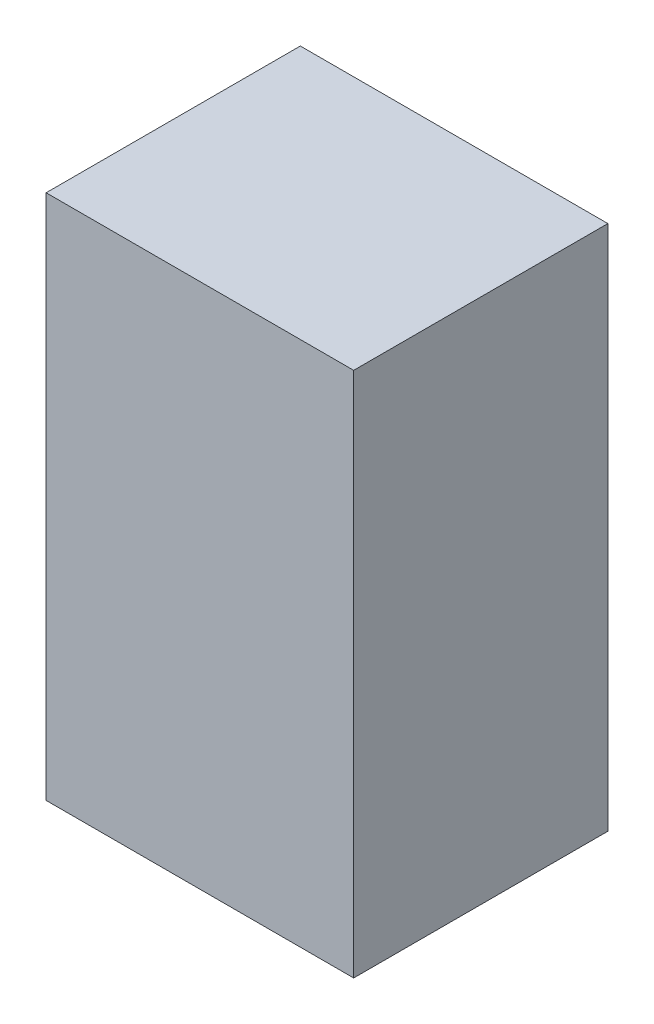
ISO-10303-21;
HEADER;
FILE_DESCRIPTION(('STEP AP214'),'2;1');
FILE_NAME('part.step','',(''),(''),'','','');
FILE_SCHEMA(('AUTOMOTIVE_DESIGN { 1 0 10303 214 1 1 1 1 }'));
ENDSEC;
DATA;
#1=APPLICATION_CONTEXT('core data for automotive mechanical design processes');
#2=APPLICATION_PROTOCOL_DEFINITION('international standard','automotive_design',2000,#1);
#3=PRODUCT_CONTEXT('',#1,'mechanical');
#4=PRODUCT('Part','Part','',(#3));
#5=PRODUCT_RELATED_PRODUCT_CATEGORY('part','',(#4));
#6=PRODUCT_DEFINITION_FORMATION('','',#4);
#7=PRODUCT_DEFINITION_CONTEXT('part definition',#1,'design');
#8=PRODUCT_DEFINITION('design','',#6,#7);
#9=PRODUCT_DEFINITION_SHAPE('','',#8);
#10=(LENGTH_UNIT() NAMED_UNIT(*) SI_UNIT(.MILLI.,.METRE.));
#11=(NAMED_UNIT(*) PLANE_ANGLE_UNIT() SI_UNIT($,.RADIAN.));
#12=(NAMED_UNIT(*) SI_UNIT($,.STERADIAN.) SOLID_ANGLE_UNIT());
#13=UNCERTAINTY_MEASURE_WITH_UNIT(LENGTH_MEASURE(1.E-05),#10,'distance_accuracy_value','');
#14=(GEOMETRIC_REPRESENTATION_CONTEXT(3) GLOBAL_UNCERTAINTY_ASSIGNED_CONTEXT((#13)) GLOBAL_UNIT_ASSIGNED_CONTEXT((#10,
#11,#12)) REPRESENTATION_CONTEXT('',''));
#15=CARTESIAN_POINT('',(0.,0.,0.));
#16=DIRECTION('',(0.,0.,1.));
#17=DIRECTION('',(1.,0.,0.));
#18=AXIS2_PLACEMENT_3D('',#15,#16,#17);
#19=CARTESIAN_POINT('',(-0.876,-1.499,0.));
#20=DIRECTION('',(0.,-1.,0.));
#21=DIRECTION('',(0.,0.,1.));
#22=AXIS2_PLACEMENT_3D('',#19,#20,#21);
#23=PLANE('',#22);
#24=DIRECTION('',(-1.,0.,0.));
#25=VECTOR('',#24,1.);
#26=CARTESIAN_POINT('',(0.876,-1.499,0.));
#27=LINE('',#26,#25);
#28=CARTESIAN_POINT('',(0.876,-1.499,0.));
#29=VERTEX_POINT('',#28);
#30=CARTESIAN_POINT('',(-0.876,-1.499,0.));
#31=VERTEX_POINT('',#30);
#32=EDGE_CURVE('E11',#29,#31,#27,.T.);
#33=ORIENTED_EDGE('',*,*,#32,.F.);
#34=DIRECTION('',(0.,0.,-1.));
#35=VECTOR('',#34,1.);
#36=CARTESIAN_POINT('',(0.876,-1.499,1.448));
#37=LINE('',#36,#35);
#38=CARTESIAN_POINT('',(0.876,-1.499,1.448));
#39=VERTEX_POINT('',#38);
#40=EDGE_CURVE('E24',#39,#29,#37,.T.);
#41=ORIENTED_EDGE('',*,*,#40,.F.);
#42=DIRECTION('',(1.,0.,0.));
#43=VECTOR('',#42,1.);
#44=CARTESIAN_POINT('',(-0.876,-1.499,1.448));
#45=LINE('',#44,#43);
#46=CARTESIAN_POINT('',(-0.876,-1.499,1.448));
#47=VERTEX_POINT('',#46);
#48=EDGE_CURVE('E88',#47,#39,#45,.T.);
#49=ORIENTED_EDGE('',*,*,#48,.F.);
#50=DIRECTION('',(0.,0.,1.));
#51=VECTOR('',#50,1.);
#52=CARTESIAN_POINT('',(-0.876,-1.499,0.));
#53=LINE('',#52,#51);
#54=EDGE_CURVE('E77',#31,#47,#53,.T.);
#55=ORIENTED_EDGE('',*,*,#54,.F.);
#56=EDGE_LOOP('',(#33,#41,#49,#55));
#57=FACE_BOUND('',#56,.T.);
#58=ADVANCED_FACE('F17',(#57),#23,.T.);
#59=CARTESIAN_POINT('',(0.876,-1.499,0.));
#60=DIRECTION('',(1.,0.,0.));
#61=DIRECTION('',(0.,0.,1.));
#62=AXIS2_PLACEMENT_3D('',#59,#60,#61);
#63=PLANE('',#62);
#64=DIRECTION('',(0.,-1.,0.));
#65=VECTOR('',#64,1.);
#66=CARTESIAN_POINT('',(0.876,1.499,0.));
#67=LINE('',#66,#65);
#68=CARTESIAN_POINT('',(0.876,1.499,0.));
#69=VERTEX_POINT('',#68);
#70=EDGE_CURVE('E85',#69,#29,#67,.T.);
#71=ORIENTED_EDGE('',*,*,#70,.F.);
#72=DIRECTION('',(0.,0.,-1.));
#73=VECTOR('',#72,1.);
#74=CARTESIAN_POINT('',(0.876,1.499,1.448));
#75=LINE('',#74,#73);
#76=CARTESIAN_POINT('',(0.876,1.499,1.448));
#77=VERTEX_POINT('',#76);
#78=EDGE_CURVE('E83',#77,#69,#75,.T.);
#79=ORIENTED_EDGE('',*,*,#78,.F.);
#80=DIRECTION('',(0.,1.,0.));
#81=VECTOR('',#80,1.);
#82=CARTESIAN_POINT('',(0.876,-1.499,1.448));
#83=LINE('',#82,#81);
#84=EDGE_CURVE('E72',#39,#77,#83,.T.);
#85=ORIENTED_EDGE('',*,*,#84,.F.);
#86=ORIENTED_EDGE('',*,*,#40,.T.);
#87=EDGE_LOOP('',(#71,#79,#85,#86));
#88=FACE_BOUND('',#87,.T.);
#89=ADVANCED_FACE('F90',(#88),#63,.T.);
#90=CARTESIAN_POINT('',(0.876,1.499,0.));
#91=DIRECTION('',(0.,1.,0.));
#92=DIRECTION('',(0.,0.,1.));
#93=AXIS2_PLACEMENT_3D('',#90,#91,#92);
#94=PLANE('',#93);
#95=DIRECTION('',(1.,0.,0.));
#96=VECTOR('',#95,1.);
#97=CARTESIAN_POINT('',(-0.876,1.499,0.));
#98=LINE('',#97,#96);
#99=CARTESIAN_POINT('',(-0.876,1.499,0.));
#100=VERTEX_POINT('',#99);
#101=EDGE_CURVE('E60',#100,#69,#98,.T.);
#102=ORIENTED_EDGE('',*,*,#101,.F.);
#103=DIRECTION('',(0.,0.,-1.));
#104=VECTOR('',#103,1.);
#105=CARTESIAN_POINT('',(-0.876,1.499,1.448));
#106=LINE('',#105,#104);
#107=CARTESIAN_POINT('',(-0.876,1.499,1.448));
#108=VERTEX_POINT('',#107);
#109=EDGE_CURVE('E54',#108,#100,#106,.T.);
#110=ORIENTED_EDGE('',*,*,#109,.F.);
#111=DIRECTION('',(-1.,0.,0.));
#112=VECTOR('',#111,1.);
#113=CARTESIAN_POINT('',(0.876,1.499,1.448));
#114=LINE('',#113,#112);
#115=EDGE_CURVE('E58',#77,#108,#114,.T.);
#116=ORIENTED_EDGE('',*,*,#115,.F.);
#117=ORIENTED_EDGE('',*,*,#78,.T.);
#118=EDGE_LOOP('',(#102,#110,#116,#117));
#119=FACE_BOUND('',#118,.T.);
#120=ADVANCED_FACE('F56',(#119),#94,.T.);
#121=CARTESIAN_POINT('',(-0.876,1.499,0.));
#122=DIRECTION('',(-1.,0.,0.));
#123=DIRECTION('',(0.,0.,1.));
#124=AXIS2_PLACEMENT_3D('',#121,#122,#123);
#125=PLANE('',#124);
#126=DIRECTION('',(0.,1.,0.));
#127=VECTOR('',#126,1.);
#128=CARTESIAN_POINT('',(-0.876,-1.499,0.));
#129=LINE('',#128,#127);
#130=EDGE_CURVE('E73',#31,#100,#129,.T.);
#131=ORIENTED_EDGE('',*,*,#130,.F.);
#132=ORIENTED_EDGE('',*,*,#54,.T.);
#133=DIRECTION('',(0.,-1.,0.));
#134=VECTOR('',#133,1.);
#135=CARTESIAN_POINT('',(-0.876,1.499,1.448));
#136=LINE('',#135,#134);
#137=EDGE_CURVE('E70',#108,#47,#136,.T.);
#138=ORIENTED_EDGE('',*,*,#137,.F.);
#139=ORIENTED_EDGE('',*,*,#109,.T.);
#140=EDGE_LOOP('',(#131,#132,#138,#139));
#141=FACE_BOUND('',#140,.T.);
#142=ADVANCED_FACE('F76',(#141),#125,.T.);
#143=CARTESIAN_POINT('',(-0.876,1.499,0.));
#144=DIRECTION('',(0.,0.,-1.));
#145=DIRECTION('',(0.,1.,0.));
#146=AXIS2_PLACEMENT_3D('',#143,#144,#145);
#147=PLANE('',#146);
#148=ORIENTED_EDGE('',*,*,#101,.T.);
#149=ORIENTED_EDGE('',*,*,#70,.T.);
#150=ORIENTED_EDGE('',*,*,#32,.T.);
#151=ORIENTED_EDGE('',*,*,#130,.T.);
#152=EDGE_LOOP('',(#148,#149,#150,#151));
#153=FACE_BOUND('',#152,.T.);
#154=ADVANCED_FACE('F91',(#153),#147,.T.);
#155=CARTESIAN_POINT('',(-0.876,-1.499,1.448));
#156=DIRECTION('',(0.,0.,1.));
#157=DIRECTION('',(0.,1.,0.));
#158=AXIS2_PLACEMENT_3D('',#155,#156,#157);
#159=PLANE('',#158);
#160=ORIENTED_EDGE('',*,*,#48,.T.);
#161=ORIENTED_EDGE('',*,*,#84,.T.);
#162=ORIENTED_EDGE('',*,*,#115,.T.);
#163=ORIENTED_EDGE('',*,*,#137,.T.);
#164=EDGE_LOOP('',(#160,#161,#162,#163));
#165=FACE_BOUND('',#164,.T.);
#166=ADVANCED_FACE('F69',(#165),#159,.T.);
#167=CLOSED_SHELL('',(#58,#89,#120,#142,#154,#166));
#168=MANIFOLD_SOLID_BREP('B1',#167);
#169=ADVANCED_BREP_SHAPE_REPRESENTATION('',(#18,#168),#14);
#170=SHAPE_DEFINITION_REPRESENTATION(#9,#169);
ENDSEC;
END-ISO-10303-21;
